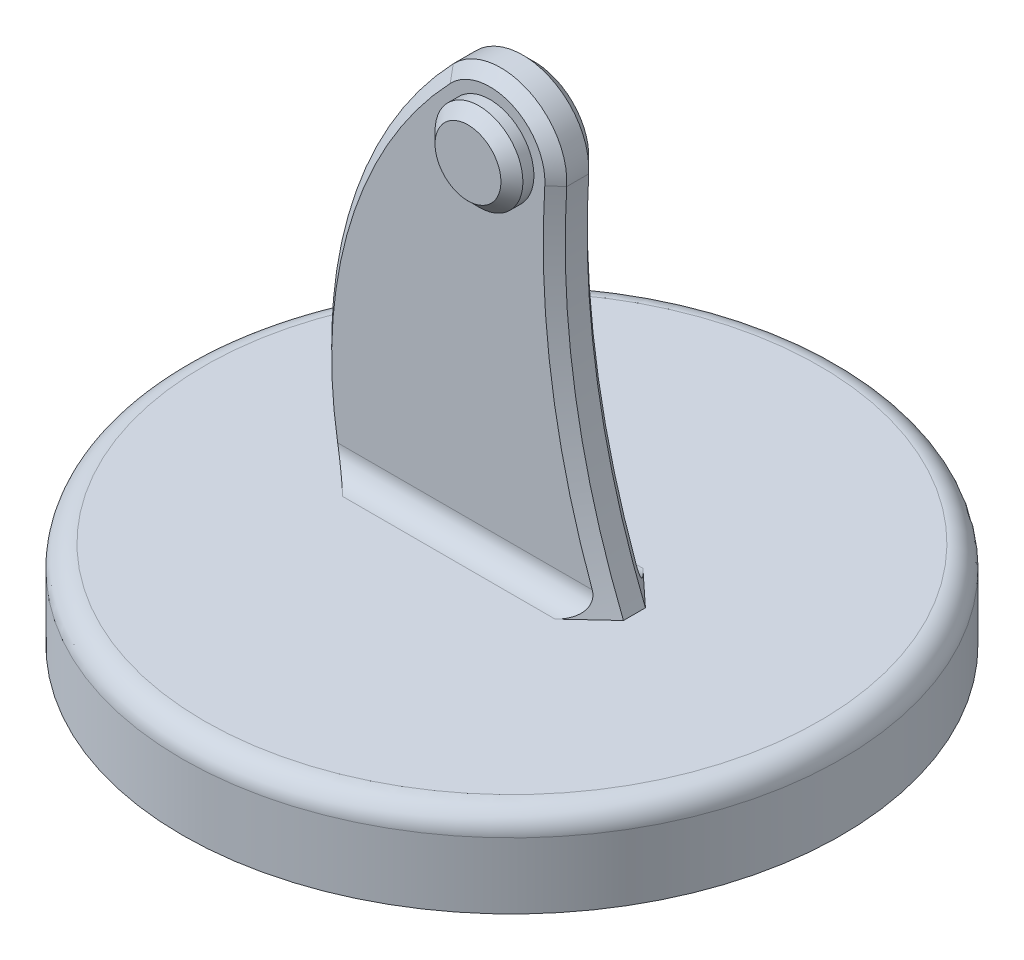
ISO-10303-21;
HEADER;
FILE_DESCRIPTION(('STEP AP214'),'2;1');
FILE_NAME('part.step','',(''),(''),'','','');
FILE_SCHEMA(('AUTOMOTIVE_DESIGN { 1 0 10303 214 1 1 1 1 }'));
ENDSEC;
DATA;
#1=APPLICATION_CONTEXT('core data for automotive mechanical design processes');
#2=APPLICATION_PROTOCOL_DEFINITION('international standard','automotive_design',2000,#1);
#3=PRODUCT_CONTEXT('',#1,'mechanical');
#4=PRODUCT('Part','Part','',(#3));
#5=PRODUCT_RELATED_PRODUCT_CATEGORY('part','',(#4));
#6=PRODUCT_DEFINITION_FORMATION('','',#4);
#7=PRODUCT_DEFINITION_CONTEXT('part definition',#1,'design');
#8=PRODUCT_DEFINITION('design','',#6,#7);
#9=PRODUCT_DEFINITION_SHAPE('','',#8);
#10=(LENGTH_UNIT() NAMED_UNIT(*) SI_UNIT(.MILLI.,.METRE.));
#11=(NAMED_UNIT(*) PLANE_ANGLE_UNIT() SI_UNIT($,.RADIAN.));
#12=(NAMED_UNIT(*) SI_UNIT($,.STERADIAN.) SOLID_ANGLE_UNIT());
#13=UNCERTAINTY_MEASURE_WITH_UNIT(LENGTH_MEASURE(1.E-05),#10,'distance_accuracy_value','');
#14=(GEOMETRIC_REPRESENTATION_CONTEXT(3) GLOBAL_UNCERTAINTY_ASSIGNED_CONTEXT((#13)) GLOBAL_UNIT_ASSIGNED_CONTEXT((#10,
#11,#12)) REPRESENTATION_CONTEXT('',''));
#15=CARTESIAN_POINT('',(0.,0.,0.));
#16=DIRECTION('',(0.,0.,1.));
#17=DIRECTION('',(1.,0.,0.));
#18=AXIS2_PLACEMENT_3D('',#15,#16,#17);
#19=CARTESIAN_POINT('',(0.,20.,0.));
#20=DIRECTION('',(0.,1.,0.));
#21=DIRECTION('',(0.,0.,1.));
#22=AXIS2_PLACEMENT_3D('',#19,#20,#21);
#23=PLANE('',#22);
#24=CARTESIAN_POINT('',(0.,20.,0.));
#25=DIRECTION('',(0.,1.,0.));
#26=DIRECTION('',(0.,0.,1.));
#27=AXIS2_PLACEMENT_3D('',#24,#25,#26);
#28=CIRCLE('',#27,70.);
#29=CARTESIAN_POINT('',(0.,20.,70.));
#30=VERTEX_POINT('',#29);
#31=EDGE_CURVE('E303',#30,#30,#28,.T.);
#32=ORIENTED_EDGE('',*,*,#31,.T.);
#33=EDGE_LOOP('',(#32));
#34=FACE_BOUND('',#33,.T.);
#35=CARTESIAN_POINT('',(-36.2257918410724,20.,-2.49999999999998));
#36=CARTESIAN_POINT('',(-35.372613344394,20.,-3.3335923545062));
#37=CARTESIAN_POINT('',(-34.5191891841924,20.,-4.1669333569709));
#38=CARTESIAN_POINT('',(-32.8109372780019,20.,-5.83391380233447));
#39=CARTESIAN_POINT('',(-31.9561089872258,20.,-6.66755268694828));
#40=CARTESIAN_POINT('',(-30.2458713230932,20.,-8.33423473891843));
#41=CARTESIAN_POINT('',(-29.390461949546,20.,-9.16727790607916));
#42=CARTESIAN_POINT('',(-28.5347400447995,20.,-9.99999999999034));
#43=B_SPLINE_CURVE_WITH_KNOTS('',3,(#35,#36,#37,#38,#39,#40,#41,#42),.UNSPECIFIED.,.F.,.F.,(4,2,
2,4),(0.,3.57842257820076,7.1604841137539,10.742546824905),.UNSPECIFIED.);
#44=CARTESIAN_POINT('',(-36.2257918410724,20.,-2.49999999999998));
#45=VERTEX_POINT('',#44);
#46=CARTESIAN_POINT('',(-28.5347400447995,20.,-10.));
#47=VERTEX_POINT('',#46);
#48=EDGE_CURVE('E128',#45,#47,#43,.T.);
#49=ORIENTED_EDGE('',*,*,#48,.T.);
#50=DIRECTION('',(-1.,0.,0.));
#51=VECTOR('',#50,1.);
#52=CARTESIAN_POINT('',(25.1824752050035,20.,-10.));
#53=LINE('',#52,#51);
#54=CARTESIAN_POINT('',(19.8084097202023,20.,-10.));
#55=VERTEX_POINT('',#54);
#56=EDGE_CURVE('E124',#47,#55,#53,.F.);
#57=ORIENTED_EDGE('',*,*,#56,.T.);
#58=CARTESIAN_POINT('',(19.8084097202023,20.,-10.0000000000159));
#59=CARTESIAN_POINT('',(20.7032286114551,20.,-9.16574365324359));
#60=CARTESIAN_POINT('',(21.5984643871082,20.,-8.33193432975297));
#61=CARTESIAN_POINT('',(23.3898068938386,20.,-6.66525336177369));
#62=CARTESIAN_POINT('',(24.2859136241564,20.,-5.83238171646875));
#63=CARTESIAN_POINT('',(26.0805990637616,20.,-4.16616784041949));
#64=CARTESIAN_POINT('',(26.979179359604,20.,-3.33282731858593));
#65=CARTESIAN_POINT('',(27.8782351753599,20.,-2.49999999999999));
#66=B_SPLINE_CURVE_WITH_KNOTS('',3,(#58,#59,#60,#61,#62,#63,#64,#65),.UNSPECIFIED.,.F.,.F.,(4,2,
2,4),(0.,3.67017170975834,7.34034022204017,11.0169040821922),.UNSPECIFIED.);
#67=CARTESIAN_POINT('',(27.8782351753599,20.,-2.49999999999998));
#68=VERTEX_POINT('',#67);
#69=EDGE_CURVE('E119',#55,#68,#66,.T.);
#70=ORIENTED_EDGE('',*,*,#69,.T.);
#71=DIRECTION('',(0.,0.,-1.));
#72=VECTOR('',#71,1.);
#73=CARTESIAN_POINT('',(27.8782351753599,20.,5.));
#74=LINE('',#73,#72);
#75=CARTESIAN_POINT('',(27.8782351753599,20.,2.5));
#76=VERTEX_POINT('',#75);
#77=EDGE_CURVE('E121',#68,#76,#74,.F.);
#78=ORIENTED_EDGE('',*,*,#77,.T.);
#79=CARTESIAN_POINT('',(27.8782351753599,20.,2.5));
#80=CARTESIAN_POINT('',(26.9791793596039,20.,3.33282731858593));
#81=CARTESIAN_POINT('',(26.0805990637616,20.,4.16616784041948));
#82=CARTESIAN_POINT('',(24.2859136241592,20.,5.8323817164661));
#83=CARTESIAN_POINT('',(23.3898068938443,20.,6.66525336176839));
#84=CARTESIAN_POINT('',(21.5984643871196,20.,8.33193432974238));
#85=CARTESIAN_POINT('',(20.7032286114692,20.,9.16574365323036));
#86=CARTESIAN_POINT('',(19.8084097202194,20.,9.99999999999999));
#87=B_SPLINE_CURVE_WITH_KNOTS('',3,(#79,#80,#81,#82,#83,#84,#85,#86),.UNSPECIFIED.,.F.,.F.,(4,2,
2,4),(0.,3.67656386015204,7.34673237242222,11.0169040821689),.UNSPECIFIED.);
#88=CARTESIAN_POINT('',(19.8084097202194,20.,10.));
#89=VERTEX_POINT('',#88);
#90=EDGE_CURVE('E207',#76,#89,#87,.T.);
#91=ORIENTED_EDGE('',*,*,#90,.T.);
#92=DIRECTION('',(-1.,0.,0.));
#93=VECTOR('',#92,1.);
#94=CARTESIAN_POINT('',(0.,20.,10.));
#95=LINE('',#94,#93);
#96=CARTESIAN_POINT('',(-28.5347400447895,20.,10.));
#97=VERTEX_POINT('',#96);
#98=EDGE_CURVE('E270',#89,#97,#95,.T.);
#99=ORIENTED_EDGE('',*,*,#98,.T.);
#100=CARTESIAN_POINT('',(-28.5347400447895,20.,9.99999999999999));
#101=CARTESIAN_POINT('',(-29.3904619495377,20.,9.1672779060872));
#102=CARTESIAN_POINT('',(-30.2458713230866,20.,8.33423473892486));
#103=CARTESIAN_POINT('',(-31.9561089872225,20.,6.6675526869515));
#104=CARTESIAN_POINT('',(-32.8109372780002,20.,5.83391380233608));
#105=CARTESIAN_POINT('',(-34.5191891841924,20.,4.16693335697091));
#106=CARTESIAN_POINT('',(-35.372613344394,20.,3.33359235450621));
#107=CARTESIAN_POINT('',(-36.2257918410724,20.,2.49999999999999));
#108=B_SPLINE_CURVE_WITH_KNOTS('',3,(#100,#101,#102,#103,#104,#105,#106,#107),.UNSPECIFIED.,.F.,
.F.,(4,2,2,4),(0.,3.582062711158,7.16412424671808,10.7425468249188),.UNSPECIFIED.);
#109=CARTESIAN_POINT('',(-36.2257918410724,20.,2.5));
#110=VERTEX_POINT('',#109);
#111=EDGE_CURVE('E201',#97,#110,#108,.T.);
#112=ORIENTED_EDGE('',*,*,#111,.T.);
#113=DIRECTION('',(0.,0.,-1.));
#114=VECTOR('',#113,1.);
#115=CARTESIAN_POINT('',(-36.2257918410724,20.,5.));
#116=LINE('',#115,#114);
#117=EDGE_CURVE('E139',#110,#45,#116,.T.);
#118=ORIENTED_EDGE('',*,*,#117,.T.);
#119=EDGE_LOOP('',(#49,#57,#70,#78,#91,#99,#112,#118));
#120=FACE_BOUND('',#119,.T.);
#121=ADVANCED_FACE('F40',(#34,#120),#23,.T.);
#122=CARTESIAN_POINT('',(0.,20.,0.));
#123=DIRECTION('',(0.,-1.,0.));
#124=DIRECTION('',(0.,0.,-1.));
#125=AXIS2_PLACEMENT_3D('',#122,#123,#124);
#126=CYLINDRICAL_SURFACE('',#125,75.);
#127=CARTESIAN_POINT('',(0.,15.,0.));
#128=DIRECTION('',(0.,1.,0.));
#129=DIRECTION('',(0.,0.,1.));
#130=AXIS2_PLACEMENT_3D('',#127,#128,#129);
#131=CIRCLE('',#130,75.);
#132=CARTESIAN_POINT('',(0.,15.,75.));
#133=VERTEX_POINT('',#132);
#134=EDGE_CURVE('E140',#133,#133,#131,.F.);
#135=ORIENTED_EDGE('',*,*,#134,.T.);
#136=EDGE_LOOP('',(#135));
#137=FACE_BOUND('',#136,.T.);
#138=CARTESIAN_POINT('',(0.,0.,0.));
#139=DIRECTION('',(0.,1.,0.));
#140=DIRECTION('',(0.,0.,1.));
#141=AXIS2_PLACEMENT_3D('',#138,#139,#140);
#142=CIRCLE('',#141,75.);
#143=CARTESIAN_POINT('',(0.,0.,75.));
#144=VERTEX_POINT('',#143);
#145=EDGE_CURVE('E295',#144,#144,#142,.T.);
#146=ORIENTED_EDGE('',*,*,#145,.T.);
#147=EDGE_LOOP('',(#146));
#148=FACE_BOUND('',#147,.T.);
#149=ADVANCED_FACE('F191',(#137,#148),#126,.T.);
#150=CARTESIAN_POINT('',(0.,0.,0.));
#151=DIRECTION('',(0.,1.,0.));
#152=DIRECTION('',(0.,0.,1.));
#153=AXIS2_PLACEMENT_3D('',#150,#151,#152);
#154=PLANE('',#153);
#155=ORIENTED_EDGE('',*,*,#145,.F.);
#156=EDGE_LOOP('',(#155));
#157=FACE_BOUND('',#156,.T.);
#158=ADVANCED_FACE('F195',(#157),#154,.F.);
#159=CARTESIAN_POINT('',(0.,15.,0.));
#160=DIRECTION('',(0.,1.,0.));
#161=DIRECTION('',(0.,0.,1.));
#162=AXIS2_PLACEMENT_3D('',#159,#160,#161);
#163=TOROIDAL_SURFACE('',#162,70.,5.);
#164=ORIENTED_EDGE('',*,*,#134,.F.);
#165=EDGE_LOOP('',(#164));
#166=FACE_BOUND('',#165,.T.);
#167=ORIENTED_EDGE('',*,*,#31,.F.);
#168=EDGE_LOOP('',(#167));
#169=FACE_BOUND('',#168,.T.);
#170=ADVANCED_FACE('F367',(#166,#169),#163,.T.);
#171=CARTESIAN_POINT('',(61.4788080980091,41.3028437243492,5.));
#172=DIRECTION('',(0.,0.,-1.));
#173=DIRECTION('',(-1.,0.,0.));
#174=AXIS2_PLACEMENT_3D('',#171,#172,#173);
#175=CYLINDRICAL_SURFACE('',#174,100.);
#176=DIRECTION('',(0.,0.,-1.));
#177=VECTOR('',#176,1.);
#178=CARTESIAN_POINT('',(-10.8492014290604,110.358321695703,5.));
#179=LINE('',#178,#177);
#180=CARTESIAN_POINT('',(-10.8492014290604,110.358321695703,2.5));
#181=VERTEX_POINT('',#180);
#182=CARTESIAN_POINT('',(-10.8492014290604,110.358321695703,-2.49999999999998));
#183=VERTEX_POINT('',#182);
#184=EDGE_CURVE('E285',#181,#183,#179,.T.);
#185=ORIENTED_EDGE('',*,*,#184,.T.);
#186=CARTESIAN_POINT('',(61.4788080980091,41.3028437243492,-2.49999999999998));
#187=DIRECTION('',(0.,0.,-1.));
#188=DIRECTION('',(-1.,0.,0.));
#189=AXIS2_PLACEMENT_3D('',#186,#187,#188);
#190=CIRCLE('',#189,100.);
#191=EDGE_CURVE('E160',#183,#45,#190,.F.);
#192=ORIENTED_EDGE('',*,*,#191,.T.);
#193=ORIENTED_EDGE('',*,*,#117,.F.);
#194=CARTESIAN_POINT('',(61.4788080980091,41.3028437243492,2.5));
#195=DIRECTION('',(0.,0.,-1.));
#196=DIRECTION('',(-1.,0.,0.));
#197=AXIS2_PLACEMENT_3D('',#194,#195,#196);
#198=CIRCLE('',#197,100.);
#199=EDGE_CURVE('E158',#110,#181,#198,.T.);
#200=ORIENTED_EDGE('',*,*,#199,.T.);
#201=EDGE_LOOP('',(#185,#192,#193,#200));
#202=FACE_BOUND('',#201,.T.);
#203=ADVANCED_FACE('F193',(#202),#175,.T.);
#204=CARTESIAN_POINT('',(194.618391581677,87.8064911464742,5.));
#205=DIRECTION('',(0.,0.,-1.));
#206=DIRECTION('',(-1.,0.,0.));
#207=AXIS2_PLACEMENT_3D('',#204,#205,#206);
#208=CYLINDRICAL_SURFACE('',#207,180.);
#209=ORIENTED_EDGE('',*,*,#77,.F.);
#210=CARTESIAN_POINT('',(194.618391581677,87.8064911464742,-2.49999999999998));
#211=DIRECTION('',(0.,0.,-1.));
#212=DIRECTION('',(-1.,0.,0.));
#213=AXIS2_PLACEMENT_3D('',#210,#211,#212);
#214=CIRCLE('',#213,180.);
#215=CARTESIAN_POINT('',(14.9706455062829,99.062037780498,-2.49999999999998));
#216=VERTEX_POINT('',#215);
#217=EDGE_CURVE('E135',#68,#216,#214,.T.);
#218=ORIENTED_EDGE('',*,*,#217,.T.);
#219=DIRECTION('',(0.,0.,-1.));
#220=VECTOR('',#219,1.);
#221=CARTESIAN_POINT('',(14.9706455062829,99.062037780498,5.));
#222=LINE('',#221,#220);
#223=CARTESIAN_POINT('',(14.9706455062829,99.062037780498,2.5));
#224=VERTEX_POINT('',#223);
#225=EDGE_CURVE('E290',#224,#216,#222,.T.);
#226=ORIENTED_EDGE('',*,*,#225,.F.);
#227=CARTESIAN_POINT('',(194.618391581677,87.8064911464742,2.5));
#228=DIRECTION('',(0.,0.,-1.));
#229=DIRECTION('',(-1.,0.,0.));
#230=AXIS2_PLACEMENT_3D('',#227,#228,#229);
#231=CIRCLE('',#230,180.);
#232=EDGE_CURVE('E138',#224,#76,#231,.F.);
#233=ORIENTED_EDGE('',*,*,#232,.T.);
#234=EDGE_LOOP('',(#209,#218,#226,#233));
#235=FACE_BOUND('',#234,.T.);
#236=ADVANCED_FACE('F133',(#235),#208,.F.);
#237=CARTESIAN_POINT('',(0.,100.,5.));
#238=DIRECTION('',(0.,0.,-1.));
#239=DIRECTION('',(-1.,0.,0.));
#240=AXIS2_PLACEMENT_3D('',#237,#238,#239);
#241=CYLINDRICAL_SURFACE('',#240,15.);
#242=ORIENTED_EDGE('',*,*,#225,.T.);
#243=CARTESIAN_POINT('',(0.,100.,-2.49999999999998));
#244=DIRECTION('',(0.,0.,-1.));
#245=DIRECTION('',(-1.,0.,0.));
#246=AXIS2_PLACEMENT_3D('',#243,#244,#245);
#247=CIRCLE('',#246,15.);
#248=EDGE_CURVE('E164',#216,#183,#247,.F.);
#249=ORIENTED_EDGE('',*,*,#248,.T.);
#250=ORIENTED_EDGE('',*,*,#184,.F.);
#251=CARTESIAN_POINT('',(0.,100.,2.5));
#252=DIRECTION('',(0.,0.,-1.));
#253=DIRECTION('',(-1.,0.,0.));
#254=AXIS2_PLACEMENT_3D('',#251,#252,#253);
#255=CIRCLE('',#254,15.);
#256=EDGE_CURVE('E162',#181,#224,#255,.T.);
#257=ORIENTED_EDGE('',*,*,#256,.T.);
#258=EDGE_LOOP('',(#242,#249,#250,#257));
#259=FACE_BOUND('',#258,.T.);
#260=ADVANCED_FACE('F318',(#259),#241,.T.);
#261=CARTESIAN_POINT('',(61.4788080980091,41.3028437243492,5.));
#262=DIRECTION('',(0.,0.,-1.));
#263=DIRECTION('',(-1.,0.,0.));
#264=AXIS2_PLACEMENT_3D('',#261,#262,#263);
#265=PLANE('',#264);
#266=CARTESIAN_POINT('',(0.,100.,5.));
#267=DIRECTION('',(0.,0.,-1.));
#268=DIRECTION('',(-1.,0.,0.));
#269=AXIS2_PLACEMENT_3D('',#266,#267,#268);
#270=CIRCLE('',#269,10.);
#271=CARTESIAN_POINT('',(-10.,100.,5.));
#272=VERTEX_POINT('',#271);
#273=EDGE_CURVE('E329',#272,#272,#270,.F.);
#274=ORIENTED_EDGE('',*,*,#273,.F.);
#275=EDGE_LOOP('',(#274));
#276=FACE_BOUND('',#275,.T.);
#277=CARTESIAN_POINT('',(61.4788080980091,41.3028437243492,5.));
#278=DIRECTION('',(0.,0.,-1.));
#279=DIRECTION('',(-1.,0.,0.));
#280=AXIS2_PLACEMENT_3D('',#277,#278,#279);
#281=CIRCLE('',#280,97.4999999999999);
#282=CARTESIAN_POINT('',(-9.04100119088368,108.631934746419,5.));
#283=VERTEX_POINT('',#282);
#284=CARTESIAN_POINT('',(-34.6485412178825,25.,5.));
#285=VERTEX_POINT('',#284);
#286=EDGE_CURVE('E129',#283,#285,#281,.F.);
#287=ORIENTED_EDGE('',*,*,#286,.T.);
#288=DIRECTION('',(-1.,0.,0.));
#289=VECTOR('',#288,1.);
#290=CARTESIAN_POINT('',(61.4788080980091,25.,5.));
#291=LINE('',#290,#289);
#292=CARTESIAN_POINT('',(23.2661384016623,25.,5.));
#293=VERTEX_POINT('',#292);
#294=EDGE_CURVE('E56',#285,#293,#291,.F.);
#295=ORIENTED_EDGE('',*,*,#294,.T.);
#296=CARTESIAN_POINT('',(194.618391581677,87.8064911464742,5.));
#297=DIRECTION('',(0.,0.,-1.));
#298=DIRECTION('',(-1.,0.,0.));
#299=AXIS2_PLACEMENT_3D('',#296,#297,#298);
#300=CIRCLE('',#299,182.5);
#301=CARTESIAN_POINT('',(12.4755379219024,99.2183648170817,5.));
#302=VERTEX_POINT('',#301);
#303=EDGE_CURVE('E166',#293,#302,#300,.T.);
#304=ORIENTED_EDGE('',*,*,#303,.T.);
#305=CARTESIAN_POINT('',(0.,100.,5.));
#306=DIRECTION('',(0.,0.,-1.));
#307=DIRECTION('',(-1.,0.,0.));
#308=AXIS2_PLACEMENT_3D('',#305,#306,#307);
#309=CIRCLE('',#308,12.5);
#310=EDGE_CURVE('E168',#302,#283,#309,.F.);
#311=ORIENTED_EDGE('',*,*,#310,.T.);
#312=EDGE_LOOP('',(#287,#295,#304,#311));
#313=FACE_BOUND('',#312,.T.);
#314=ADVANCED_FACE('F326',(#276,#313),#265,.F.);
#315=CARTESIAN_POINT('',(61.4788080980091,41.3028437243492,-5.));
#316=DIRECTION('',(0.,0.,-1.));
#317=DIRECTION('',(-1.,0.,0.));
#318=AXIS2_PLACEMENT_3D('',#315,#316,#317);
#319=PLANE('',#318);
#320=CARTESIAN_POINT('',(0.,100.,-5.));
#321=DIRECTION('',(0.,0.,-1.));
#322=DIRECTION('',(-1.,0.,0.));
#323=AXIS2_PLACEMENT_3D('',#320,#321,#322);
#324=CIRCLE('',#323,5.);
#325=CARTESIAN_POINT('',(-5.,100.,-5.));
#326=VERTEX_POINT('',#325);
#327=EDGE_CURVE('E298',#326,#326,#324,.T.);
#328=ORIENTED_EDGE('',*,*,#327,.F.);
#329=EDGE_LOOP('',(#328));
#330=FACE_BOUND('',#329,.T.);
#331=CARTESIAN_POINT('',(194.618391581677,87.8064911464742,-5.));
#332=DIRECTION('',(0.,0.,-1.));
#333=DIRECTION('',(-1.,0.,0.));
#334=AXIS2_PLACEMENT_3D('',#331,#332,#333);
#335=CIRCLE('',#334,182.5);
#336=CARTESIAN_POINT('',(12.4755379219024,99.2183648170817,-5.));
#337=VERTEX_POINT('',#336);
#338=CARTESIAN_POINT('',(23.2661384016623,25.,-5.));
#339=VERTEX_POINT('',#338);
#340=EDGE_CURVE('E155',#337,#339,#335,.F.);
#341=ORIENTED_EDGE('',*,*,#340,.T.);
#342=DIRECTION('',(-1.,0.,0.));
#343=VECTOR('',#342,1.);
#344=CARTESIAN_POINT('',(-33.6654972978261,25.,-5.));
#345=LINE('',#344,#343);
#346=CARTESIAN_POINT('',(-34.6485412178825,25.,-5.));
#347=VERTEX_POINT('',#346);
#348=EDGE_CURVE('E273',#339,#347,#345,.T.);
#349=ORIENTED_EDGE('',*,*,#348,.T.);
#350=CARTESIAN_POINT('',(61.4788080980091,41.3028437243492,-5.));
#351=DIRECTION('',(0.,0.,-1.));
#352=DIRECTION('',(-1.,0.,0.));
#353=AXIS2_PLACEMENT_3D('',#350,#351,#352);
#354=CIRCLE('',#353,97.4999999999999);
#355=CARTESIAN_POINT('',(-9.04100119088368,108.631934746419,-5.));
#356=VERTEX_POINT('',#355);
#357=EDGE_CURVE('E149',#347,#356,#354,.T.);
#358=ORIENTED_EDGE('',*,*,#357,.T.);
#359=CARTESIAN_POINT('',(0.,100.,-5.));
#360=DIRECTION('',(0.,0.,-1.));
#361=DIRECTION('',(-1.,0.,0.));
#362=AXIS2_PLACEMENT_3D('',#359,#360,#361);
#363=CIRCLE('',#362,12.5);
#364=EDGE_CURVE('E147',#356,#337,#363,.T.);
#365=ORIENTED_EDGE('',*,*,#364,.T.);
#366=EDGE_LOOP('',(#341,#349,#358,#365));
#367=FACE_BOUND('',#366,.T.);
#368=ADVANCED_FACE('F315',(#330,#367),#319,.T.);
#369=CARTESIAN_POINT('',(61.4788080980091,41.3028437243492,-2.49999999999998));
#370=DIRECTION('',(0.,0.,1.));
#371=DIRECTION('',(1.,0.,0.));
#372=AXIS2_PLACEMENT_3D('',#369,#370,#371);
#373=CONICAL_SURFACE('',#372,100.,0.785398163397456);
#374=ORIENTED_EDGE('',*,*,#48,.F.);
#375=ORIENTED_EDGE('',*,*,#191,.F.);
#376=DIRECTION('',(-0.511436260063163,0.488295967516227,0.707106781186545));
#377=VECTOR('',#376,1.);
#378=CARTESIAN_POINT('',(-9.04100119088366,108.631934746419,-5.));
#379=LINE('',#378,#377);
#380=EDGE_CURVE('E283',#356,#183,#379,.T.);
#381=ORIENTED_EDGE('',*,*,#380,.F.);
#382=ORIENTED_EDGE('',*,*,#357,.F.);
#383=CARTESIAN_POINT('',(-34.6485412178825,25.,-5.));
#384=CARTESIAN_POINT('',(-34.6278263931645,24.8776737195309,-4.99997205696549));
#385=CARTESIAN_POINT('',(-34.6024065399032,24.7562262915276,-5.00448739117207));
#386=CARTESIAN_POINT('',(-34.5429849208854,24.5162780856462,-5.02201019394859));
#387=CARTESIAN_POINT('',(-34.5089975298439,24.3977727337697,-5.03500349551893));
#388=CARTESIAN_POINT('',(-34.4336064530606,24.1657504184647,-5.06870753536354));
#389=CARTESIAN_POINT('',(-34.3922873438698,24.0521932495797,-5.08933290323475));
#390=CARTESIAN_POINT('',(-34.3028186663441,23.8293395597508,-5.13763804893629));
#391=CARTESIAN_POINT('',(-34.2546663483714,23.7200447766429,-5.16532067014758));
#392=CARTESIAN_POINT('',(-34.1018999874641,23.4007855163625,-5.25749953763443));
#393=CARTESIAN_POINT('',(-33.9883894250089,23.1977010164338,-5.33139897333394));
#394=CARTESIAN_POINT('',(-33.7431081280649,22.8114075187661,-5.49947966844371));
#395=CARTESIAN_POINT('',(-33.6112792288647,22.6282652833932,-5.59372608368113));
#396=CARTESIAN_POINT('',(-33.3597715899797,22.3143795242673,-5.77930779563056));
#397=CARTESIAN_POINT('',(-33.2423430904441,22.1802045011359,-5.86796813176536));
#398=CARTESIAN_POINT('',(-33.0003701704358,21.9250062885372,-6.05419427532));
#399=CARTESIAN_POINT('',(-32.8758222627859,21.803989629899,-6.15176446112315));
#400=CARTESIAN_POINT('',(-32.620958183914,21.574515672378,-6.35451763345836));
#401=CARTESIAN_POINT('',(-32.4906317175557,21.4660821453441,-6.45971443821713));
#402=CARTESIAN_POINT('',(-32.2256565914918,21.261571364397,-6.6763962469599));
#403=CARTESIAN_POINT('',(-32.091008151286,21.1654934842151,-6.78788093181869));
#404=CARTESIAN_POINT('',(-31.767082979519,20.9513521781692,-7.05916234626258));
#405=CARTESIAN_POINT('',(-31.5762977372454,20.8386006241572,-7.22136644551829));
#406=CARTESIAN_POINT('',(-31.1903799013299,20.6347373401019,-7.55407285197027));
#407=CARTESIAN_POINT('',(-30.995245384709,20.543635398434,-7.72457887087088));
#408=CARTESIAN_POINT('',(-30.6024455629515,20.3825905264103,-8.07225279463919));
#409=CARTESIAN_POINT('',(-30.4047817757243,20.312635473578,-8.24941681705508));
#410=CARTESIAN_POINT('',(-30.0083154260171,20.1935947017099,-8.60919264195968));
#411=CARTESIAN_POINT('',(-29.8095134145845,20.144499628215,-8.79180196315533));
#412=CARTESIAN_POINT('',(-29.4304409321058,20.0707858186542,-9.14430295407236));
#413=CARTESIAN_POINT('',(-29.2501629713123,20.0443183217429,-9.31380200505617));
#414=CARTESIAN_POINT('',(-28.8911755946429,20.0089730286601,-9.65518491269285));
#415=CARTESIAN_POINT('',(-28.7124631020954,20.0000429318062,-9.82706013433485));
#416=CARTESIAN_POINT('',(-28.5347400447948,20.,-9.99999999999492));
#417=B_SPLINE_CURVE_WITH_KNOTS('',3,(#383,#384,#385,#386,#387,#388,#389,#390,#391,#392,#393,
#394,#395,#396,#397,#398,#399,#400,#401,#402,#403,#404,#405,#406,#407,#408,#409,#410,#411,#412,
#413,#414,#415,#416),.UNSPECIFIED.,.F.,.F.,(4,2,2,2,2,2,2,2,2,2,2,2,2,2,2,2,4),(0.,
0.3719103404576,0.743200791013902,1.11045779196235,1.47786299596238,2.20715942536887,
2.93882682183085,3.53541228861897,4.13229251712416,4.73028261116157,5.3282423830098,
6.15097947183994,6.97408783764377,7.79672345698737,8.61898978287112,9.36494146338214,
10.1086651405441),.UNSPECIFIED.);
#418=EDGE_CURVE('E261',#347,#47,#417,.T.);
#419=ORIENTED_EDGE('',*,*,#418,.T.);
#420=EDGE_LOOP('',(#374,#375,#381,#382,#419));
#421=FACE_BOUND('',#420,.T.);
#422=ADVANCED_FACE('F225',(#421),#373,.T.);
#423=CARTESIAN_POINT('',(0.,100.,-2.49999999999998));
#424=DIRECTION('',(0.,0.,1.));
#425=DIRECTION('',(1.,0.,0.));
#426=AXIS2_PLACEMENT_3D('',#423,#424,#425);
#427=CONICAL_SURFACE('',#426,15.,0.785398163397452);
#428=ORIENTED_EDGE('',*,*,#380,.T.);
#429=ORIENTED_EDGE('',*,*,#248,.F.);
#430=DIRECTION('',(0.705722997082171,-0.0442159630604421,0.707106781186545));
#431=VECTOR('',#430,1.);
#432=CARTESIAN_POINT('',(12.4755379219024,99.2183648170817,-5.));
#433=LINE('',#432,#431);
#434=EDGE_CURVE('E145',#337,#216,#433,.T.);
#435=ORIENTED_EDGE('',*,*,#434,.F.);
#436=ORIENTED_EDGE('',*,*,#364,.F.);
#437=EDGE_LOOP('',(#428,#429,#435,#436));
#438=FACE_BOUND('',#437,.T.);
#439=ADVANCED_FACE('F316',(#438),#427,.T.);
#440=CARTESIAN_POINT('',(194.618391581677,87.8064911464742,-2.49999999999998));
#441=DIRECTION('',(0.,0.,-1.));
#442=DIRECTION('',(-1.,0.,0.));
#443=AXIS2_PLACEMENT_3D('',#440,#441,#442);
#444=CONICAL_SURFACE('',#443,180.,0.785398163397456);
#445=ORIENTED_EDGE('',*,*,#69,.F.);
#446=CARTESIAN_POINT('',(19.8084097202023,20.,-10.));
#447=CARTESIAN_POINT('',(19.9616222001239,20.0000298804785,-9.85714704114017));
#448=CARTESIAN_POINT('',(20.1137924014172,20.0061250464782,-9.71309524721198));
#449=CARTESIAN_POINT('',(20.415409925848,20.0312732005126,-9.42286389259949));
#450=CARTESIAN_POINT('',(20.5648530265969,20.0503447774566,-9.2766815742795));
#451=CARTESIAN_POINT('',(20.8615528966843,20.1025626520142,-8.98125926299825));
#452=CARTESIAN_POINT('',(21.0087676549866,20.1358611613062,-8.83200332023971));
#453=CARTESIAN_POINT('',(21.2980316141147,20.2175964036326,-8.53280806026981));
#454=CARTESIAN_POINT('',(21.4400838108838,20.2660241950141,-8.38286919812097));
#455=CARTESIAN_POINT('',(21.7828151280901,20.405835219887,-8.01276165534503));
#456=CARTESIAN_POINT('',(21.9797828513795,20.5067135935929,-7.79259954803282));
#457=CARTESIAN_POINT('',(22.3528762269413,20.7482032050752,-7.35729519113177));
#458=CARTESIAN_POINT('',(22.5290705137488,20.8886780845652,-7.14213841035201));
#459=CARTESIAN_POINT('',(22.8168193138918,21.1785477540671,-6.76898245709451));
#460=CARTESIAN_POINT('',(22.9340909878609,21.3193171678203,-6.60875060096347));
#461=CARTESIAN_POINT('',(23.1447782575388,21.6294430522906,-6.30040897896256));
#462=CARTESIAN_POINT('',(23.2382153446267,21.7987735392614,-6.15228837499754));
#463=CARTESIAN_POINT('',(23.3804737185168,22.1320581970144,-5.89995104941797));
#464=CARTESIAN_POINT('',(23.4342962789298,22.291504954021,-5.7926288505865));
#465=CARTESIAN_POINT('',(23.5179262343748,22.626385576124,-5.59504489143033));
#466=CARTESIAN_POINT('',(23.5477623016983,22.801800073964,-5.50476286124248));
#467=CARTESIAN_POINT('',(23.5813327898909,23.1648092903662,-5.34473112728349));
#468=CARTESIAN_POINT('',(23.5849884501376,23.352439050097,-5.27504398311246));
#469=CARTESIAN_POINT('',(23.5658130806131,23.733709875498,-5.15889768650694));
#470=CARTESIAN_POINT('',(23.5429456120547,23.9273588546054,-5.11247061551816));
#471=CARTESIAN_POINT('',(23.4808763212392,24.2692712797666,-5.05137708232151));
#472=CARTESIAN_POINT('',(23.4467017445601,24.4176298806907,-5.03183845273491));
#473=CARTESIAN_POINT('',(23.3858266399039,24.6380272597173,-5.01257591131666));
#474=CARTESIAN_POINT('',(23.3639728403144,24.7110279587212,-5.00782892798896));
#475=CARTESIAN_POINT('',(23.3172604092302,24.856188778062,-5.00154052901008));
#476=CARTESIAN_POINT('',(23.2924023157315,24.9283490463695,-4.99999854031963));
#477=CARTESIAN_POINT('',(23.2661384016623,25.,-4.99999999999999));
#478=B_SPLINE_CURVE_WITH_KNOTS('',3,(#446,#447,#448,#449,#450,#451,#452,#453,#454,#455,#456,
#457,#458,#459,#460,#461,#462,#463,#464,#465,#466,#467,#468,#469,#470,#471,#472,#473,#474,#475,
#476,#477),.UNSPECIFIED.,.F.,.F.,(4,2,2,2,2,2,2,2,2,2,2,2,2,2,2,4),(0.,0.628421039599251,
1.25774420264544,1.89397597557005,2.52983243422408,3.46357701051946,4.39414453598006,
5.12178326458327,5.84876355163627,6.44503340287271,7.04058943782025,7.63793638210759,
8.23610496423552,8.6953462470199,8.92427835402073,9.15316952542153),.UNSPECIFIED.);
#479=EDGE_CURVE('E236',#55,#339,#478,.T.);
#480=ORIENTED_EDGE('',*,*,#479,.T.);
#481=ORIENTED_EDGE('',*,*,#340,.F.);
#482=ORIENTED_EDGE('',*,*,#434,.T.);
#483=ORIENTED_EDGE('',*,*,#217,.F.);
#484=EDGE_LOOP('',(#445,#480,#481,#482,#483));
#485=FACE_BOUND('',#484,.T.);
#486=ADVANCED_FACE('F142',(#485),#444,.F.);
#487=CARTESIAN_POINT('',(194.618391581677,87.8064911464742,5.));
#488=DIRECTION('',(0.,0.,1.));
#489=DIRECTION('',(1.,0.,0.));
#490=AXIS2_PLACEMENT_3D('',#487,#488,#489);
#491=CONICAL_SURFACE('',#490,182.5,0.785398163397459);
#492=ORIENTED_EDGE('',*,*,#90,.F.);
#493=ORIENTED_EDGE('',*,*,#232,.F.);
#494=DIRECTION('',(0.705722997082173,-0.0442159630604423,-0.707106781186542));
#495=VECTOR('',#494,1.);
#496=CARTESIAN_POINT('',(12.4755379219024,99.2183648170817,5.));
#497=LINE('',#496,#495);
#498=EDGE_CURVE('E276',#302,#224,#497,.T.);
#499=ORIENTED_EDGE('',*,*,#498,.F.);
#500=ORIENTED_EDGE('',*,*,#303,.F.);
#501=CARTESIAN_POINT('',(23.2661384016623,25.,5.));
#502=CARTESIAN_POINT('',(23.3002005671832,24.9070970588888,4.99998982101167));
#503=CARTESIAN_POINT('',(23.3319003658588,24.8132947634358,5.00258916549921));
#504=CARTESIAN_POINT('',(23.3901604515582,24.6243431264429,5.01323591479231));
#505=CARTESIAN_POINT('',(23.4167170425787,24.5291928685387,5.02128721893147));
#506=CARTESIAN_POINT('',(23.4642590261444,24.3379983044757,5.04308274610182));
#507=CARTESIAN_POINT('',(23.4852365999852,24.2419529368185,5.05683489026829));
#508=CARTESIAN_POINT('',(23.5211837982652,24.0497650147842,5.09015681555101));
#509=CARTESIAN_POINT('',(23.5361548951619,23.9536224900254,5.10972516880294));
#510=CARTESIAN_POINT('',(23.5598434730769,23.7615087850931,5.15480488443815));
#511=CARTESIAN_POINT('',(23.5685335526405,23.6655401561134,5.18034165170114));
#512=CARTESIAN_POINT('',(23.579358971121,23.4749236099918,5.23722376580067));
#513=CARTESIAN_POINT('',(23.5814919758389,23.3802761751035,5.26857117691084));
#514=CARTESIAN_POINT('',(23.5791344482645,23.1932936963799,5.33677201100208));
#515=CARTESIAN_POINT('',(23.5746576512134,23.1009542616797,5.37361387353917));
#516=CARTESIAN_POINT('',(23.5591775223304,22.919061246429,5.45252524641229));
#517=CARTESIAN_POINT('',(23.5481717304808,22.8295087293356,5.49459672245525));
#518=CARTESIAN_POINT('',(23.520532895729,22.6581681393704,5.58133674973435));
#519=CARTESIAN_POINT('',(23.5042028834637,22.5762147571267,5.62577615786903));
#520=CARTESIAN_POINT('',(23.466096025912,22.4158463901558,5.71855815688245));
#521=CARTESIAN_POINT('',(23.4443173998559,22.3374325721739,5.76690202034876));
#522=CARTESIAN_POINT('',(23.3712669897884,22.1079558946016,5.91717329223244));
#523=CARTESIAN_POINT('',(23.3122859316014,21.9626892734793,6.02432427062642));
#524=CARTESIAN_POINT('',(23.151924605642,21.6389242665395,6.29030441266746));
#525=CARTESIAN_POINT('',(23.0429297160745,21.4679275550975,6.4536187634793));
#526=CARTESIAN_POINT('',(22.8002588719762,21.1580788280493,6.79181102146743));
#527=CARTESIAN_POINT('',(22.6665421365392,21.0192807927284,6.96670772427775));
#528=CARTESIAN_POINT('',(22.319763824735,20.7186526437609,7.39885475877629));
#529=CARTESIAN_POINT('',(22.0972299147781,20.5723698914755,7.65932857124397));
#530=CARTESIAN_POINT('',(21.7458214725292,20.3928428518393,8.05194856088023));
#531=CARTESIAN_POINT('',(21.6254999159943,20.3395856596789,8.18339715955418));
#532=CARTESIAN_POINT('',(21.3800348286689,20.2454846645251,8.44627656448096));
#533=CARTESIAN_POINT('',(21.2548922835544,20.2046383390843,8.5777073689152));
#534=CARTESIAN_POINT('',(21.0216039690423,20.1402893934769,8.81843555286567));
#535=CARTESIAN_POINT('',(20.9140295433622,20.115042165326,8.92783397103434));
#536=CARTESIAN_POINT('',(20.6966536902155,20.0722321318853,9.14592246129716));
#537=CARTESIAN_POINT('',(20.5868522553933,20.0546693519809,9.25461253105012));
#538=CARTESIAN_POINT('',(20.3664141647905,20.0269838470988,9.47008454014685));
#539=CARTESIAN_POINT('',(20.2557937252112,20.0167960789621,9.57687485159777));
#540=CARTESIAN_POINT('',(20.0331107499651,20.0033093732439,9.78932326315866));
#541=CARTESIAN_POINT('',(19.9210486204084,20.0000085366556,9.89498166738485));
#542=CARTESIAN_POINT('',(19.8084097202194,20.,9.99999999999999));
#543=B_SPLINE_CURVE_WITH_KNOTS('',3,(#501,#502,#503,#504,#505,#506,#507,#508,#509,#510,#511,
#512,#513,#514,#515,#516,#517,#518,#519,#520,#521,#522,#523,#524,#525,#526,#527,#528,#529,#530,
#531,#532,#533,#534,#535,#536,#537,#538,#539,#540,#541,#542),.UNSPECIFIED.,.F.,.F.,(4,2,2,2,2,2,
2,2,2,2,2,2,2,2,2,2,2,2,2,2,4),(0.,0.296831377796512,0.593875278954073,0.891333303938966,
1.18871836397785,1.48739308625392,1.78617411897319,2.08433515458882,2.38260860379719,
2.66622794573051,2.94994010430046,3.51747042312946,4.29430082789701,5.07242430682297,
6.18341813208099,6.74108455291984,7.29863755488188,7.76491483358031,8.23119365260234,
8.69330833935972,9.15529558547919),.UNSPECIFIED.);
#544=EDGE_CURVE('E235',#293,#89,#543,.T.);
#545=ORIENTED_EDGE('',*,*,#544,.T.);
#546=EDGE_LOOP('',(#492,#493,#499,#500,#545));
#547=FACE_BOUND('',#546,.T.);
#548=ADVANCED_FACE('F258',(#547),#491,.F.);
#549=CARTESIAN_POINT('',(0.,100.,5.));
#550=DIRECTION('',(0.,0.,-1.));
#551=DIRECTION('',(-1.,0.,0.));
#552=AXIS2_PLACEMENT_3D('',#549,#550,#551);
#553=CONICAL_SURFACE('',#552,12.5,0.785398163397456);
#554=ORIENTED_EDGE('',*,*,#498,.T.);
#555=ORIENTED_EDGE('',*,*,#256,.F.);
#556=DIRECTION('',(-0.511436260063165,0.488295967516228,-0.707106781186542));
#557=VECTOR('',#556,1.);
#558=CARTESIAN_POINT('',(-9.04100119088368,108.631934746419,5.));
#559=LINE('',#558,#557);
#560=EDGE_CURVE('E279',#283,#181,#559,.T.);
#561=ORIENTED_EDGE('',*,*,#560,.F.);
#562=ORIENTED_EDGE('',*,*,#310,.F.);
#563=EDGE_LOOP('',(#554,#555,#561,#562));
#564=FACE_BOUND('',#563,.T.);
#565=ADVANCED_FACE('F223',(#564),#553,.T.);
#566=CARTESIAN_POINT('',(61.4788080980091,41.3028437243492,5.));
#567=DIRECTION('',(0.,0.,-1.));
#568=DIRECTION('',(-1.,0.,0.));
#569=AXIS2_PLACEMENT_3D('',#566,#567,#568);
#570=CONICAL_SURFACE('',#569,97.4999999999999,0.785398163397459);
#571=ORIENTED_EDGE('',*,*,#560,.T.);
#572=ORIENTED_EDGE('',*,*,#199,.F.);
#573=ORIENTED_EDGE('',*,*,#111,.F.);
#574=CARTESIAN_POINT('',(-28.5347400447895,20.,10.));
#575=CARTESIAN_POINT('',(-28.6394037298973,20.000005434771,9.89815059591552));
#576=CARTESIAN_POINT('',(-28.7444044701095,20.0031117141702,9.79667872726322));
#577=CARTESIAN_POINT('',(-28.9548959740973,20.015430758412,9.59462953884506));
#578=CARTESIAN_POINT('',(-29.0603867081498,20.0246431575365,9.49405216587012));
#579=CARTESIAN_POINT('',(-29.3774210581303,20.0613070700193,9.19377282554194));
#580=CARTESIAN_POINT('',(-29.5894429565535,20.0977851443199,8.9956051842325));
#581=CARTESIAN_POINT('',(-30.014947034864,20.1948303369437,8.60300164617533));
#582=CARTESIAN_POINT('',(-30.2284255574993,20.2556075268316,8.40861421626863));
#583=CARTESIAN_POINT('',(-30.6533009098753,20.4012836398836,8.02679361368092));
#584=CARTESIAN_POINT('',(-30.8646984190368,20.486174400497,7.83935811197357));
#585=CARTESIAN_POINT('',(-31.2358180513899,20.6583962515183,7.51482560986984));
#586=CARTESIAN_POINT('',(-31.3963375276232,20.7407622681904,7.37599142315449));
#587=CARTESIAN_POINT('',(-31.7140120771383,20.920552010497,7.10437811445687));
#588=CARTESIAN_POINT('',(-31.8711678474206,21.0179725815724,6.97159773148071));
#589=CARTESIAN_POINT('',(-32.180485652205,21.2281280967815,6.71357483416334));
#590=CARTESIAN_POINT('',(-32.3326604747658,21.340819251485,6.58831219251083));
#591=CARTESIAN_POINT('',(-32.6308687242772,21.5823060586908,6.34643164579907));
#592=CARTESIAN_POINT('',(-32.7769045910204,21.7110952309636,6.22981029212433));
#593=CARTESIAN_POINT('',(-33.1114401131506,22.0342782323159,5.96739519381316));
#594=CARTESIAN_POINT('',(-33.2966353855765,22.2357416578196,5.82592043060813));
#595=CARTESIAN_POINT('',(-33.6456704142065,22.6710303913349,5.5683239835165));
#596=CARTESIAN_POINT('',(-33.809530172219,22.9048249589202,5.45217848375558));
#597=CARTESIAN_POINT('',(-34.0707148956103,23.3443131711605,5.27769119806797));
#598=CARTESIAN_POINT('',(-34.1745553911898,23.5431850809405,5.21216424392805));
#599=CARTESIAN_POINT('',(-34.3129103192238,23.8535368517304,5.13204069721148));
#600=CARTESIAN_POINT('',(-34.3560939901829,23.9588861391615,5.10837492195165));
#601=CARTESIAN_POINT('',(-34.4360284136755,24.1732140859586,5.06762637880011));
#602=CARTESIAN_POINT('',(-34.4727823057823,24.2821909429161,5.05054039316327));
#603=CARTESIAN_POINT('',(-34.5357563799719,24.4918108462674,5.02489103654147));
#604=CARTESIAN_POINT('',(-34.5626708259065,24.5921598661021,5.01563242611837));
#605=CARTESIAN_POINT('',(-34.6103490298529,24.7948018697914,5.00317605161259));
#606=CARTESIAN_POINT('',(-34.6311052843732,24.8970970648735,4.99998565599897));
#607=CARTESIAN_POINT('',(-34.6485412178825,25.,5.));
#608=B_SPLINE_CURVE_WITH_KNOTS('',3,(#574,#575,#576,#577,#578,#579,#580,#581,#582,#583,#584,
#585,#586,#587,#588,#589,#590,#591,#592,#593,#594,#595,#596,#597,#598,#599,#600,#601,#602,#603,
#604,#605,#606,#607),.UNSPECIFIED.,.F.,.F.,(4,2,2,2,2,2,2,2,2,2,2,2,2,2,2,2,4),(0.,
0.438046358396595,0.876066482945899,1.75245654359026,2.63659295844558,3.52043044513268,
4.20284499036575,4.8851167346074,5.56547186306231,6.24555399245995,7.16678571132561,
8.08714747013599,8.78553853656564,9.13405477041008,9.48240035064402,9.79495848648637,
10.107895911521),.UNSPECIFIED.);
#609=EDGE_CURVE('E64',#97,#285,#608,.T.);
#610=ORIENTED_EDGE('',*,*,#609,.T.);
#611=ORIENTED_EDGE('',*,*,#286,.F.);
#612=EDGE_LOOP('',(#571,#572,#573,#610,#611));
#613=FACE_BOUND('',#612,.T.);
#614=ADVANCED_FACE('F215',(#613),#570,.T.);
#615=CARTESIAN_POINT('',(61.4788080980091,25.,-10.));
#616=DIRECTION('',(1.,0.,0.));
#617=DIRECTION('',(0.,0.,-1.));
#618=AXIS2_PLACEMENT_3D('',#615,#616,#617);
#619=CYLINDRICAL_SURFACE('',#618,5.);
#620=ORIENTED_EDGE('',*,*,#479,.F.);
#621=ORIENTED_EDGE('',*,*,#56,.F.);
#622=ORIENTED_EDGE('',*,*,#418,.F.);
#623=ORIENTED_EDGE('',*,*,#348,.F.);
#624=EDGE_LOOP('',(#620,#621,#622,#623));
#625=FACE_BOUND('',#624,.T.);
#626=ADVANCED_FACE('F222',(#625),#619,.F.);
#627=CARTESIAN_POINT('',(0.,25.,10.));
#628=DIRECTION('',(-1.,0.,0.));
#629=DIRECTION('',(0.,0.,1.));
#630=AXIS2_PLACEMENT_3D('',#627,#628,#629);
#631=CYLINDRICAL_SURFACE('',#630,5.);
#632=ORIENTED_EDGE('',*,*,#544,.F.);
#633=ORIENTED_EDGE('',*,*,#294,.F.);
#634=ORIENTED_EDGE('',*,*,#609,.F.);
#635=ORIENTED_EDGE('',*,*,#98,.F.);
#636=EDGE_LOOP('',(#632,#633,#634,#635));
#637=FACE_BOUND('',#636,.T.);
#638=ADVANCED_FACE('F248',(#637),#631,.F.);
#639=CARTESIAN_POINT('',(0.,100.,10.));
#640=DIRECTION('',(0.,0.,-1.));
#641=DIRECTION('',(-1.,0.,0.));
#642=AXIS2_PLACEMENT_3D('',#639,#640,#641);
#643=CYLINDRICAL_SURFACE('',#642,10.);
#644=CARTESIAN_POINT('',(0.,100.,7.49999999999989));
#645=DIRECTION('',(0.,0.,1.));
#646=DIRECTION('',(1.,0.,0.));
#647=AXIS2_PLACEMENT_3D('',#644,#645,#646);
#648=CIRCLE('',#647,10.);
#649=CARTESIAN_POINT('',(10.,100.,7.49999999999989));
#650=VERTEX_POINT('',#649);
#651=EDGE_CURVE('E11',#650,#650,#648,.F.);
#652=ORIENTED_EDGE('',*,*,#651,.T.);
#653=EDGE_LOOP('',(#652));
#654=FACE_BOUND('',#653,.T.);
#655=ORIENTED_EDGE('',*,*,#273,.T.);
#656=EDGE_LOOP('',(#655));
#657=FACE_BOUND('',#656,.T.);
#658=ADVANCED_FACE('F251',(#654,#657),#643,.T.);
#659=CARTESIAN_POINT('',(0.,100.,10.));
#660=DIRECTION('',(0.,0.,1.));
#661=DIRECTION('',(1.,0.,0.));
#662=AXIS2_PLACEMENT_3D('',#659,#660,#661);
#663=PLANE('',#662);
#664=CARTESIAN_POINT('',(0.,100.,10.));
#665=DIRECTION('',(0.,0.,1.));
#666=DIRECTION('',(1.,0.,0.));
#667=AXIS2_PLACEMENT_3D('',#664,#665,#666);
#668=CIRCLE('',#667,7.4999999999999);
#669=CARTESIAN_POINT('',(7.4999999999999,100.,10.));
#670=VERTEX_POINT('',#669);
#671=EDGE_CURVE('E49',#670,#670,#668,.T.);
#672=ORIENTED_EDGE('',*,*,#671,.T.);
#673=EDGE_LOOP('',(#672));
#674=FACE_BOUND('',#673,.T.);
#675=ADVANCED_FACE('F336',(#674),#663,.T.);
#676=CARTESIAN_POINT('',(0.,100.,10.));
#677=DIRECTION('',(0.,0.,-1.));
#678=DIRECTION('',(-1.,0.,0.));
#679=AXIS2_PLACEMENT_3D('',#676,#677,#678);
#680=CONICAL_SURFACE('',#679,7.4999999999999,0.785398163397447);
#681=ORIENTED_EDGE('',*,*,#651,.F.);
#682=EDGE_LOOP('',(#681));
#683=FACE_BOUND('',#682,.T.);
#684=ORIENTED_EDGE('',*,*,#671,.F.);
#685=EDGE_LOOP('',(#684));
#686=FACE_BOUND('',#685,.T.);
#687=ADVANCED_FACE('F43',(#683,#686),#680,.T.);
#688=CARTESIAN_POINT('',(0.,100.,5.));
#689=DIRECTION('',(0.,0.,-1.));
#690=DIRECTION('',(-1.,0.,0.));
#691=AXIS2_PLACEMENT_3D('',#688,#689,#690);
#692=CYLINDRICAL_SURFACE('',#691,5.);
#693=CARTESIAN_POINT('',(0.,100.,5.));
#694=DIRECTION('',(0.,0.,-1.));
#695=DIRECTION('',(-1.,0.,0.));
#696=AXIS2_PLACEMENT_3D('',#693,#694,#695);
#697=CIRCLE('',#696,5.);
#698=CARTESIAN_POINT('',(-5.,100.,5.));
#699=VERTEX_POINT('',#698);
#700=EDGE_CURVE('E282',#699,#699,#697,.T.);
#701=ORIENTED_EDGE('',*,*,#700,.F.);
#702=EDGE_LOOP('',(#701));
#703=FACE_BOUND('',#702,.T.);
#704=ORIENTED_EDGE('',*,*,#327,.T.);
#705=EDGE_LOOP('',(#704));
#706=FACE_BOUND('',#705,.T.);
#707=ADVANCED_FACE('F339',(#703,#706),#692,.F.);
#708=CARTESIAN_POINT('',(0.,100.,5.));
#709=DIRECTION('',(0.,0.,-1.));
#710=DIRECTION('',(-1.,0.,0.));
#711=AXIS2_PLACEMENT_3D('',#708,#709,#710);
#712=PLANE('',#711);
#713=ORIENTED_EDGE('',*,*,#700,.T.);
#714=EDGE_LOOP('',(#713));
#715=FACE_BOUND('',#714,.T.);
#716=ADVANCED_FACE('F345',(#715),#712,.T.);
#717=CLOSED_SHELL('',(#121,#149,#158,#170,#203,#236,#260,#314,#368,#422,#439,#486,#548,#565,
#614,#626,#638,#658,#675,#687,#707,#716));
#718=MANIFOLD_SOLID_BREP('B2',#717);
#719=ADVANCED_BREP_SHAPE_REPRESENTATION('',(#18,#718),#14);
#720=SHAPE_DEFINITION_REPRESENTATION(#9,#719);
ENDSEC;
END-ISO-10303-21;
